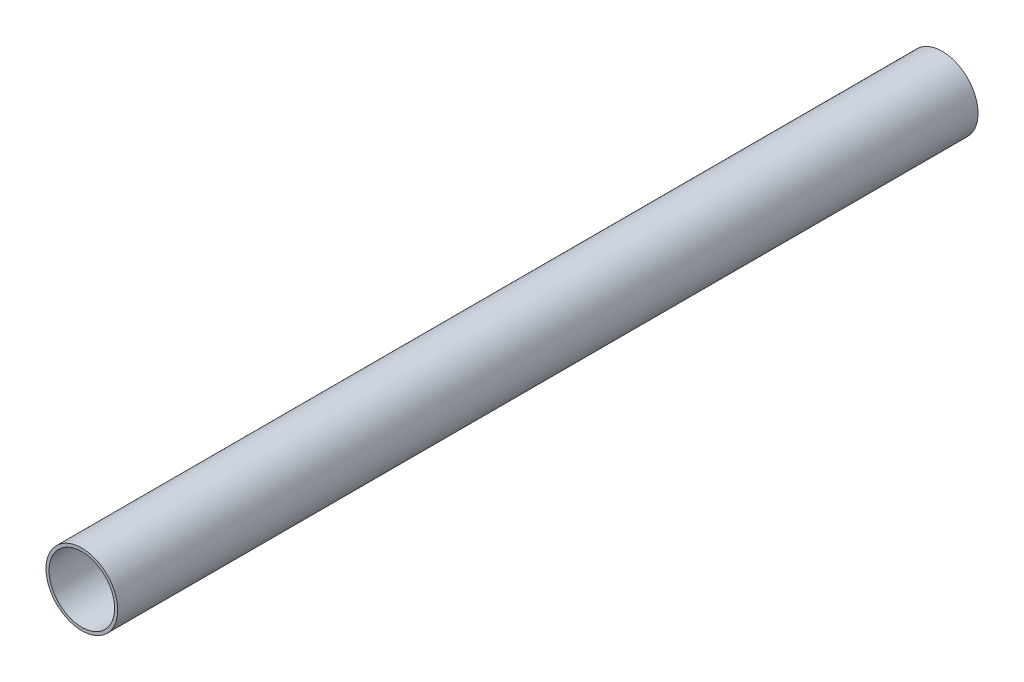
ISO-10303-21;
HEADER;
FILE_DESCRIPTION(('STEP AP214'),'2;1');
FILE_NAME('part.step','',(''),(''),'','','');
FILE_SCHEMA(('AUTOMOTIVE_DESIGN { 1 0 10303 214 1 1 1 1 }'));
ENDSEC;
DATA;
#1=APPLICATION_CONTEXT('core data for automotive mechanical design processes');
#2=APPLICATION_PROTOCOL_DEFINITION('international standard','automotive_design',2000,#1);
#3=PRODUCT_CONTEXT('',#1,'mechanical');
#4=PRODUCT('Part','Part','',(#3));
#5=PRODUCT_RELATED_PRODUCT_CATEGORY('part','',(#4));
#6=PRODUCT_DEFINITION_FORMATION('','',#4);
#7=PRODUCT_DEFINITION_CONTEXT('part definition',#1,'design');
#8=PRODUCT_DEFINITION('design','',#6,#7);
#9=PRODUCT_DEFINITION_SHAPE('','',#8);
#10=(LENGTH_UNIT() NAMED_UNIT(*) SI_UNIT(.MILLI.,.METRE.));
#11=(NAMED_UNIT(*) PLANE_ANGLE_UNIT() SI_UNIT($,.RADIAN.));
#12=(NAMED_UNIT(*) SI_UNIT($,.STERADIAN.) SOLID_ANGLE_UNIT());
#13=UNCERTAINTY_MEASURE_WITH_UNIT(LENGTH_MEASURE(1.E-05),#10,'distance_accuracy_value','');
#14=(GEOMETRIC_REPRESENTATION_CONTEXT(3) GLOBAL_UNCERTAINTY_ASSIGNED_CONTEXT((#13)) GLOBAL_UNIT_ASSIGNED_CONTEXT((#10,
#11,#12)) REPRESENTATION_CONTEXT('',''));
#15=CARTESIAN_POINT('',(0.,0.,0.));
#16=DIRECTION('',(0.,0.,1.));
#17=DIRECTION('',(1.,0.,0.));
#18=AXIS2_PLACEMENT_3D('',#15,#16,#17);
#19=CARTESIAN_POINT('',(-70.7106781186548,70.7106781186547,387.35));
#20=DIRECTION('',(0.,0.,-1.));
#21=DIRECTION('',(-1.,0.,0.));
#22=AXIS2_PLACEMENT_3D('',#19,#20,#21);
#23=CYLINDRICAL_SURFACE('',#22,10.414);
#24=CARTESIAN_POINT('',(-70.7106781186548,70.7106781186547,211.9));
#25=DIRECTION('',(0.,0.,-1.));
#26=DIRECTION('',(-1.,0.,0.));
#27=AXIS2_PLACEMENT_3D('',#24,#25,#26);
#28=CIRCLE('',#27,10.414);
#29=CARTESIAN_POINT('',(-81.1246781186548,70.7106781186547,211.9));
#30=VERTEX_POINT('',#29);
#31=EDGE_CURVE('E10',#30,#30,#28,.T.);
#32=ORIENTED_EDGE('',*,*,#31,.T.);
#33=EDGE_LOOP('',(#32));
#34=FACE_BOUND('',#33,.T.);
#35=CARTESIAN_POINT('',(-70.7106781186548,70.7106781186547,-38.1));
#36=DIRECTION('',(0.,0.,-1.));
#37=DIRECTION('',(-1.,0.,0.));
#38=AXIS2_PLACEMENT_3D('',#35,#36,#37);
#39=CIRCLE('',#38,10.414);
#40=CARTESIAN_POINT('',(-81.1246781186548,70.7106781186547,-38.1));
#41=VERTEX_POINT('',#40);
#42=EDGE_CURVE('E54',#41,#41,#39,.T.);
#43=ORIENTED_EDGE('',*,*,#42,.F.);
#44=EDGE_LOOP('',(#43));
#45=FACE_BOUND('',#44,.T.);
#46=ADVANCED_FACE('F37',(#34,#45),#23,.T.);
#47=CARTESIAN_POINT('',(-60.2966781186548,70.7106781186547,211.9));
#48=DIRECTION('',(0.,0.,1.));
#49=DIRECTION('',(1.,0.,0.));
#50=AXIS2_PLACEMENT_3D('',#47,#48,#49);
#51=PLANE('',#50);
#52=CARTESIAN_POINT('',(-70.7106781186548,70.7106781186547,211.9));
#53=DIRECTION('',(0.,0.,-1.));
#54=DIRECTION('',(-1.,0.,0.));
#55=AXIS2_PLACEMENT_3D('',#52,#53,#54);
#56=CIRCLE('',#55,9.52499999999996);
#57=CARTESIAN_POINT('',(-80.2356781186548,70.7106781186547,211.9));
#58=VERTEX_POINT('',#57);
#59=EDGE_CURVE('E44',#58,#58,#56,.T.);
#60=ORIENTED_EDGE('',*,*,#59,.T.);
#61=EDGE_LOOP('',(#60));
#62=FACE_BOUND('',#61,.T.);
#63=ORIENTED_EDGE('',*,*,#31,.F.);
#64=EDGE_LOOP('',(#63));
#65=FACE_BOUND('',#64,.T.);
#66=ADVANCED_FACE('F65',(#62,#65),#51,.T.);
#67=CARTESIAN_POINT('',(-70.7106781186548,70.7106781186547,387.35));
#68=DIRECTION('',(0.,0.,-1.));
#69=DIRECTION('',(-1.,0.,0.));
#70=AXIS2_PLACEMENT_3D('',#67,#68,#69);
#71=CYLINDRICAL_SURFACE('',#70,9.52499999999998);
#72=CARTESIAN_POINT('',(-70.7106781186548,70.7106781186547,-38.1));
#73=DIRECTION('',(0.,0.,-1.));
#74=DIRECTION('',(-1.,0.,0.));
#75=AXIS2_PLACEMENT_3D('',#72,#73,#74);
#76=CIRCLE('',#75,9.525);
#77=CARTESIAN_POINT('',(-80.2356781186548,70.7106781186547,-38.1));
#78=VERTEX_POINT('',#77);
#79=EDGE_CURVE('E49',#78,#78,#76,.T.);
#80=ORIENTED_EDGE('',*,*,#79,.T.);
#81=EDGE_LOOP('',(#80));
#82=FACE_BOUND('',#81,.T.);
#83=ORIENTED_EDGE('',*,*,#59,.F.);
#84=EDGE_LOOP('',(#83));
#85=FACE_BOUND('',#84,.T.);
#86=ADVANCED_FACE('F69',(#82,#85),#71,.F.);
#87=CARTESIAN_POINT('',(-61.1856781186548,70.7106781186547,-38.1));
#88=DIRECTION('',(0.,0.,-1.));
#89=DIRECTION('',(-1.,0.,0.));
#90=AXIS2_PLACEMENT_3D('',#87,#88,#89);
#91=PLANE('',#90);
#92=ORIENTED_EDGE('',*,*,#42,.T.);
#93=EDGE_LOOP('',(#92));
#94=FACE_BOUND('',#93,.T.);
#95=ORIENTED_EDGE('',*,*,#79,.F.);
#96=EDGE_LOOP('',(#95));
#97=FACE_BOUND('',#96,.T.);
#98=ADVANCED_FACE('F61',(#94,#97),#91,.T.);
#99=CLOSED_SHELL('',(#46,#66,#86,#98));
#100=MANIFOLD_SOLID_BREP('B2',#99);
#101=ADVANCED_BREP_SHAPE_REPRESENTATION('',(#18,#100),#14);
#102=SHAPE_DEFINITION_REPRESENTATION(#9,#101);
ENDSEC;
END-ISO-10303-21;
